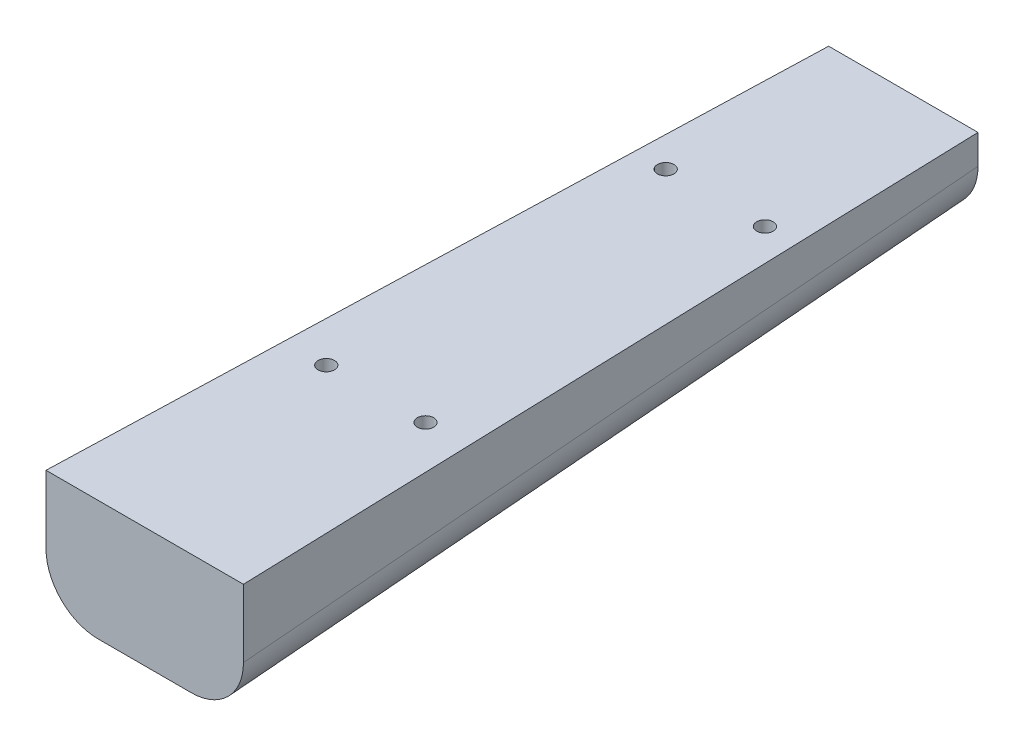
ISO-10303-21;
HEADER;
FILE_DESCRIPTION(('STEP AP214'),'2;1');
FILE_NAME('part.step','',(''),(''),'','','');
FILE_SCHEMA(('AUTOMOTIVE_DESIGN { 1 0 10303 214 1 1 1 1 }'));
ENDSEC;
DATA;
#1=APPLICATION_CONTEXT('core data for automotive mechanical design processes');
#2=APPLICATION_PROTOCOL_DEFINITION('international standard','automotive_design',2000,#1);
#3=PRODUCT_CONTEXT('',#1,'mechanical');
#4=PRODUCT('Part','Part','',(#3));
#5=PRODUCT_RELATED_PRODUCT_CATEGORY('part','',(#4));
#6=PRODUCT_DEFINITION_FORMATION('','',#4);
#7=PRODUCT_DEFINITION_CONTEXT('part definition',#1,'design');
#8=PRODUCT_DEFINITION('design','',#6,#7);
#9=PRODUCT_DEFINITION_SHAPE('','',#8);
#10=(LENGTH_UNIT() NAMED_UNIT(*) SI_UNIT(.MILLI.,.METRE.));
#11=(NAMED_UNIT(*) PLANE_ANGLE_UNIT() SI_UNIT($,.RADIAN.));
#12=(NAMED_UNIT(*) SI_UNIT($,.STERADIAN.) SOLID_ANGLE_UNIT());
#13=UNCERTAINTY_MEASURE_WITH_UNIT(LENGTH_MEASURE(1.E-05),#10,'distance_accuracy_value','');
#14=(GEOMETRIC_REPRESENTATION_CONTEXT(3) GLOBAL_UNCERTAINTY_ASSIGNED_CONTEXT((#13)) GLOBAL_UNIT_ASSIGNED_CONTEXT((#10,
#11,#12)) REPRESENTATION_CONTEXT('',''));
#15=CARTESIAN_POINT('',(0.,0.,0.));
#16=DIRECTION('',(0.,0.,1.));
#17=DIRECTION('',(1.,0.,0.));
#18=AXIS2_PLACEMENT_3D('',#15,#16,#17);
#19=CARTESIAN_POINT('',(0.,20.723241317766,0.));
#20=DIRECTION('',(0.,1.,0.));
#21=DIRECTION('',(0.,0.,1.));
#22=AXIS2_PLACEMENT_3D('',#19,#20,#21);
#23=PLANE('',#22);
#24=DIRECTION('',(-1.,0.,0.));
#25=VECTOR('',#24,1.);
#26=CARTESIAN_POINT('',(0.,20.723241317766,-1173.17130026192));
#27=LINE('',#26,#25);
#28=CARTESIAN_POINT('',(24.0069483527925,20.723241317766,-1173.17130026192));
#29=VERTEX_POINT('',#28);
#30=CARTESIAN_POINT('',(-24.0069483527925,20.723241317766,-1173.17130026192));
#31=VERTEX_POINT('',#30);
#32=EDGE_CURVE('E116',#29,#31,#27,.T.);
#33=ORIENTED_EDGE('',*,*,#32,.F.);
#34=DIRECTION('',(-0.0316721902279269,0.,-0.999498310336824));
#35=VECTOR('',#34,1.);
#36=CARTESIAN_POINT('',(61.1211296763861,20.723241317766,-1.93681172447798));
#37=LINE('',#36,#35);
#38=CARTESIAN_POINT('',(18.161,20.723241317766,-1357.6554));
#39=VERTEX_POINT('',#38);
#40=EDGE_CURVE('E125',#29,#39,#37,.T.);
#41=ORIENTED_EDGE('',*,*,#40,.T.);
#42=DIRECTION('',(-1.,0.,0.));
#43=VECTOR('',#42,1.);
#44=CARTESIAN_POINT('',(0.,20.723241317766,-1357.6554));
#45=LINE('',#44,#43);
#46=CARTESIAN_POINT('',(-18.161,20.723241317766,-1357.6554));
#47=VERTEX_POINT('',#46);
#48=EDGE_CURVE('E105',#39,#47,#45,.T.);
#49=ORIENTED_EDGE('',*,*,#48,.T.);
#50=DIRECTION('',(-0.0316721902279268,0.,0.999498310336824));
#51=VECTOR('',#50,1.);
#52=CARTESIAN_POINT('',(-61.1211296763861,20.723241317766,-1.93681172447797));
#53=LINE('',#52,#51);
#54=EDGE_CURVE('E123',#47,#31,#53,.T.);
#55=ORIENTED_EDGE('',*,*,#54,.T.);
#56=EDGE_LOOP('',(#33,#41,#49,#55));
#57=FACE_BOUND('',#56,.T.);
#58=CARTESIAN_POINT('',(12.065,20.723241317766,-1229.3854));
#59=DIRECTION('',(0.,1.,0.));
#60=DIRECTION('',(0.,0.,1.));
#61=AXIS2_PLACEMENT_3D('',#58,#59,#60);
#62=CIRCLE('',#61,2.);
#63=CARTESIAN_POINT('',(12.065,20.723241317766,-1227.3854));
#64=VERTEX_POINT('',#63);
#65=EDGE_CURVE('E131',#64,#64,#62,.F.);
#66=ORIENTED_EDGE('',*,*,#65,.T.);
#67=EDGE_LOOP('',(#66));
#68=FACE_BOUND('',#67,.T.);
#69=CARTESIAN_POINT('',(12.065,20.723241317766,-1311.9354));
#70=DIRECTION('',(0.,1.,0.));
#71=DIRECTION('',(0.,0.,1.));
#72=AXIS2_PLACEMENT_3D('',#69,#70,#71);
#73=CIRCLE('',#72,2.);
#74=CARTESIAN_POINT('',(12.065,20.723241317766,-1309.9354));
#75=VERTEX_POINT('',#74);
#76=EDGE_CURVE('E361',#75,#75,#73,.F.);
#77=ORIENTED_EDGE('',*,*,#76,.T.);
#78=EDGE_LOOP('',(#77));
#79=FACE_BOUND('',#78,.T.);
#80=CARTESIAN_POINT('',(-12.065,20.723241317766,-1229.3854));
#81=DIRECTION('',(0.,1.,0.));
#82=DIRECTION('',(0.,0.,1.));
#83=AXIS2_PLACEMENT_3D('',#80,#81,#82);
#84=CIRCLE('',#83,2.);
#85=CARTESIAN_POINT('',(-12.065,20.723241317766,-1227.3854));
#86=VERTEX_POINT('',#85);
#87=EDGE_CURVE('E364',#86,#86,#84,.F.);
#88=ORIENTED_EDGE('',*,*,#87,.T.);
#89=EDGE_LOOP('',(#88));
#90=FACE_BOUND('',#89,.T.);
#91=CARTESIAN_POINT('',(-12.065,20.723241317766,-1311.9354));
#92=DIRECTION('',(0.,1.,0.));
#93=DIRECTION('',(0.,0.,1.));
#94=AXIS2_PLACEMENT_3D('',#91,#92,#93);
#95=CIRCLE('',#94,2.);
#96=CARTESIAN_POINT('',(-12.065,20.723241317766,-1309.9354));
#97=VERTEX_POINT('',#96);
#98=EDGE_CURVE('E127',#97,#97,#95,.F.);
#99=ORIENTED_EDGE('',*,*,#98,.T.);
#100=EDGE_LOOP('',(#99));
#101=FACE_BOUND('',#100,.T.);
#102=ADVANCED_FACE('F45',(#57,#68,#79,#90,#101),#23,.T.);
#103=CARTESIAN_POINT('',(0.,0.,-1173.17130026192));
#104=DIRECTION('',(0.,0.,1.));
#105=DIRECTION('',(1.,0.,0.));
#106=AXIS2_PLACEMENT_3D('',#103,#104,#105);
#107=PLANE('',#106);
#108=DIRECTION('',(0.,1.,0.));
#109=VECTOR('',#108,1.);
#110=CARTESIAN_POINT('',(24.0069483527925,0.,-1173.17130026192));
#111=LINE('',#110,#109);
#112=CARTESIAN_POINT('',(24.0069483527925,4.23140159115264,-1173.17130026192));
#113=VERTEX_POINT('',#112);
#114=EDGE_CURVE('E272',#113,#29,#111,.T.);
#115=ORIENTED_EDGE('',*,*,#114,.T.);
#116=ORIENTED_EDGE('',*,*,#32,.T.);
#117=DIRECTION('',(0.,-1.,0.));
#118=VECTOR('',#117,1.);
#119=CARTESIAN_POINT('',(-24.0069483527925,0.,-1173.17130026192));
#120=LINE('',#119,#118);
#121=CARTESIAN_POINT('',(-24.0069483527925,4.23140159115264,-1173.17130026192));
#122=VERTEX_POINT('',#121);
#123=EDGE_CURVE('E63',#31,#122,#120,.T.);
#124=ORIENTED_EDGE('',*,*,#123,.T.);
#125=CARTESIAN_POINT('',(-11.3005736959707,4.25179537602321,-1173.17130026192));
#126=DIRECTION('',(0.,0.,1.));
#127=DIRECTION('',(-0.52999894000318,-0.847998304005088,0.));
#128=AXIS2_PLACEMENT_3D('',#125,#126,#127);
#129=ELLIPSE('',#128,12.7226792238703,12.7);
#130=CARTESIAN_POINT('',(-11.320951542641,-8.46451736446796,-1173.17130026192));
#131=VERTEX_POINT('',#130);
#132=EDGE_CURVE('E67',#131,#122,#129,.F.);
#133=ORIENTED_EDGE('',*,*,#132,.F.);
#134=DIRECTION('',(1.,0.,0.));
#135=VECTOR('',#134,1.);
#136=CARTESIAN_POINT('',(0.,-8.46451736446795,-1173.17130026192));
#137=LINE('',#136,#135);
#138=CARTESIAN_POINT('',(11.320951542641,-8.46451736446796,-1173.17130026192));
#139=VERTEX_POINT('',#138);
#140=EDGE_CURVE('E219',#131,#139,#137,.T.);
#141=ORIENTED_EDGE('',*,*,#140,.T.);
#142=CARTESIAN_POINT('',(11.3005736959707,4.2517953760232,-1173.17130026192));
#143=DIRECTION('',(0.,0.,1.));
#144=DIRECTION('',(0.52999894000318,-0.847998304005088,0.));
#145=AXIS2_PLACEMENT_3D('',#142,#143,#144);
#146=ELLIPSE('',#145,12.7226792238703,12.7);
#147=EDGE_CURVE('E273',#113,#139,#146,.F.);
#148=ORIENTED_EDGE('',*,*,#147,.F.);
#149=EDGE_LOOP('',(#115,#116,#124,#133,#141,#148));
#150=FACE_BOUND('',#149,.T.);
#151=ADVANCED_FACE('F175',(#150),#107,.T.);
#152=CARTESIAN_POINT('',(0.,0.,-1357.6554));
#153=DIRECTION('',(0.,0.,1.));
#154=DIRECTION('',(1.,0.,0.));
#155=AXIS2_PLACEMENT_3D('',#152,#153,#154);
#156=PLANE('',#155);
#157=ORIENTED_EDGE('',*,*,#48,.F.);
#158=CARTESIAN_POINT('',(18.161,13.5849189556207,-1357.6554));
#159=DIRECTION('',(0.,1.,0.));
#160=VECTOR('',#159,1.);
#161=LINE('',#158,#160);
#162=CARTESIAN_POINT('',(18.161,13.5849189556207,-1357.6554));
#163=VERTEX_POINT('',#162);
#164=EDGE_CURVE('E151',#163,#39,#161,.T.);
#165=ORIENTED_EDGE('',*,*,#164,.F.);
#166=CARTESIAN_POINT('',(5.45462534317825,13.6053127404912,-1357.6554));
#167=DIRECTION('',(0.,0.,1.));
#168=DIRECTION('',(0.52999894000318,-0.847998304005088,0.));
#169=AXIS2_PLACEMENT_3D('',#166,#167,#168);
#170=ELLIPSE('',#169,12.7226792238703,12.7);
#171=CARTESIAN_POINT('',(5.47500318984843,0.889000000000046,-1357.6554));
#172=VERTEX_POINT('',#171);
#173=EDGE_CURVE('E158',#163,#172,#170,.F.);
#174=ORIENTED_EDGE('',*,*,#173,.T.);
#175=CARTESIAN_POINT('',(-5.47500318984845,0.88900000000007,-1357.6554));
#176=DIRECTION('',(1.,0.,0.));
#177=VECTOR('',#176,1.);
#178=LINE('',#175,#177);
#179=CARTESIAN_POINT('',(-5.47500318984845,0.889000000000046,-1357.6554));
#180=VERTEX_POINT('',#179);
#181=EDGE_CURVE('E115',#180,#172,#178,.T.);
#182=ORIENTED_EDGE('',*,*,#181,.F.);
#183=CARTESIAN_POINT('',(-5.45462534317825,13.6053127404912,-1357.6554));
#184=DIRECTION('',(0.,0.,1.));
#185=DIRECTION('',(-0.52999894000318,-0.847998304005088,0.));
#186=AXIS2_PLACEMENT_3D('',#183,#184,#185);
#187=ELLIPSE('',#186,12.7226792238703,12.7);
#188=CARTESIAN_POINT('',(-18.161,13.5849189556206,-1357.6554));
#189=VERTEX_POINT('',#188);
#190=EDGE_CURVE('E109',#180,#189,#187,.F.);
#191=ORIENTED_EDGE('',*,*,#190,.T.);
#192=CARTESIAN_POINT('',(-18.161,20.723241317766,-1357.6554));
#193=DIRECTION('',(0.,-1.,0.));
#194=VECTOR('',#193,1.);
#195=LINE('',#192,#194);
#196=EDGE_CURVE('E100',#47,#189,#195,.T.);
#197=ORIENTED_EDGE('',*,*,#196,.F.);
#198=EDGE_LOOP('',(#157,#165,#174,#182,#191,#197));
#199=FACE_BOUND('',#198,.T.);
#200=ADVANCED_FACE('F103',(#199),#156,.F.);
#201=CARTESIAN_POINT('',(61.1211296763861,0.,-1.93681172447798));
#202=DIRECTION('',(-0.999498310336824,0.,0.0316721902279269));
#203=DIRECTION('',(0.0316721902279269,0.,0.999498310336824));
#204=AXIS2_PLACEMENT_3D('',#201,#202,#203);
#205=PLANE('',#204);
#206=ORIENTED_EDGE('',*,*,#40,.F.);
#207=ORIENTED_EDGE('',*,*,#114,.F.);
#208=DIRECTION('',(0.0316316011868878,-0.0506105618990205,0.99821741761533));
#209=VECTOR('',#208,1.);
#210=CARTESIAN_POINT('',(61.0328383585854,-55.010022418116,-4.72307381510543));
#211=LINE('',#210,#209);
#212=EDGE_CURVE('E208',#113,#163,#211,.F.);
#213=ORIENTED_EDGE('',*,*,#212,.T.);
#214=ORIENTED_EDGE('',*,*,#164,.T.);
#215=EDGE_LOOP('',(#206,#207,#213,#214));
#216=FACE_BOUND('',#215,.T.);
#217=ADVANCED_FACE('F47',(#216),#205,.F.);
#218=CARTESIAN_POINT('',(-61.1211296763861,0.,-1.93681172447797));
#219=DIRECTION('',(0.999498310336824,0.,0.0316721902279268));
#220=DIRECTION('',(0.0316721902279268,0.,-0.999498310336824));
#221=AXIS2_PLACEMENT_3D('',#218,#219,#220);
#222=PLANE('',#221);
#223=ORIENTED_EDGE('',*,*,#54,.F.);
#224=ORIENTED_EDGE('',*,*,#196,.T.);
#225=DIRECTION('',(-0.0316316011868878,-0.0506105618990205,0.998217417615331));
#226=VECTOR('',#225,1.);
#227=CARTESIAN_POINT('',(-61.0328383585854,-55.010022418116,-4.72307381510543));
#228=LINE('',#227,#226);
#229=EDGE_CURVE('E152',#189,#122,#228,.T.);
#230=ORIENTED_EDGE('',*,*,#229,.T.);
#231=ORIENTED_EDGE('',*,*,#123,.F.);
#232=EDGE_LOOP('',(#223,#224,#230,#231));
#233=FACE_BOUND('',#232,.T.);
#234=ADVANCED_FACE('F126',(#233),#222,.F.);
#235=CARTESIAN_POINT('',(-12.065,-8.46454236446797,-1311.9354));
#236=DIRECTION('',(0.,1.,0.));
#237=DIRECTION('',(0.,0.,1.));
#238=AXIS2_PLACEMENT_3D('',#235,#236,#237);
#239=CYLINDRICAL_SURFACE('',#238,2.);
#240=CARTESIAN_POINT('',(-12.065,-0.470140429083495,-1309.9354));
#241=CARTESIAN_POINT('',(-12.190454449731,-0.415341292933901,-1309.93540396265));
#242=CARTESIAN_POINT('',(-12.3147965376713,-0.357825540674882,-1309.94722872973));
#243=CARTESIAN_POINT('',(-12.5576515044099,-0.239271997339739,-1309.99307880621));
#244=CARTESIAN_POINT('',(-12.676156369196,-0.178229601155399,-1310.02713376971));
#245=CARTESIAN_POINT('',(-12.9040702864242,-0.0549241538420164,-1310.11581929779));
#246=CARTESIAN_POINT('',(-13.0135015529651,0.00733542546131464,-1310.17039768522));
#247=CARTESIAN_POINT('',(-13.2210813264998,0.130911919171698,-1310.29882460603));
#248=CARTESIAN_POINT('',(-13.3192260085461,0.192228507942954,-1310.37267964457));
#249=CARTESIAN_POINT('',(-13.5042894338816,0.312953488417157,-1310.54092770665));
#250=CARTESIAN_POINT('',(-13.5907887018879,0.372251285058992,-1310.63586508078));
#251=CARTESIAN_POINT('',(-13.7455385415762,0.48326561128192,-1310.84339445578));
#252=CARTESIAN_POINT('',(-13.8138191960381,0.534994574000619,-1310.95595686004));
#253=CARTESIAN_POINT('',(-13.9128189132748,0.614278224864288,-1311.16399884294));
#254=CARTESIAN_POINT('',(-13.9487000752468,0.644597025312217,-1311.2559815529));
#255=CARTESIAN_POINT('',(-14.0068389379443,0.697028322639501,-1311.44637876111));
#256=CARTESIAN_POINT('',(-14.0291087127825,0.719148085678401,-1311.54478747308));
#257=CARTESIAN_POINT('',(-14.0586329668677,0.753661716402574,-1311.74611509245));
#258=CARTESIAN_POINT('',(-14.0658044840359,0.766001615717355,-1311.84905576262));
#259=CARTESIAN_POINT('',(-14.0640527830666,0.779734017751632,-1312.05553552442));
#260=CARTESIAN_POINT('',(-14.0551346963718,0.781130010042434,-1312.15907441476));
#261=CARTESIAN_POINT('',(-14.0230194721182,0.773383772555391,-1312.35372606988));
#262=CARTESIAN_POINT('',(-14.0012005977893,0.765192205873714,-1312.44511017099));
#263=CARTESIAN_POINT('',(-13.9454309909002,0.74055809562651,-1312.62290464556));
#264=CARTESIAN_POINT('',(-13.9114788471525,0.724114592210732,-1312.70931443912));
#265=CARTESIAN_POINT('',(-13.8317451741576,0.683648918813197,-1312.87747461129));
#266=CARTESIAN_POINT('',(-13.7856736963208,0.659437252459765,-1312.9590405459));
#267=CARTESIAN_POINT('',(-13.6837634530327,0.605078941662254,-1313.11361311257));
#268=CARTESIAN_POINT('',(-13.627920893696,0.574929991335225,-1313.1866164015));
#269=CARTESIAN_POINT('',(-13.4999578219864,0.505813588080991,-1313.33236609096));
#270=CARTESIAN_POINT('',(-13.4266591374857,0.466206015478173,-1313.40377265977));
#271=CARTESIAN_POINT('',(-13.2714225407743,0.383109302755104,-1313.53377749464));
#272=CARTESIAN_POINT('',(-13.1894795127747,0.339617866497458,-1313.59236811236));
#273=CARTESIAN_POINT('',(-13.0059167863356,0.24367970921894,-1313.70397692244));
#274=CARTESIAN_POINT('',(-12.9031856682751,0.190865205123441,-1313.7548583087));
#275=CARTESIAN_POINT('',(-12.6910063813151,0.0842351423158335,-1313.8383255582));
#276=CARTESIAN_POINT('',(-12.5815549515295,0.0304191066003398,-1313.87090246052));
#277=CARTESIAN_POINT('',(-12.3491567739239,-0.0809357351828239,-1313.91894678507));
#278=CARTESIAN_POINT('',(-12.2258406345682,-0.138416496738399,-1313.93278580799));
#279=CARTESIAN_POINT('',(-11.9775658396401,-0.25075839939859,-1313.93734057183));
#280=CARTESIAN_POINT('',(-11.8526071717571,-0.305619520854926,-1313.92805613934));
#281=CARTESIAN_POINT('',(-11.606511097759,-0.410544123921925,-1313.8860826057));
#282=CARTESIAN_POINT('',(-11.485345229936,-0.460660151966255,-1313.85369547759));
#283=CARTESIAN_POINT('',(-11.2494768495882,-0.555712792852206,-1313.76590147467));
#284=CARTESIAN_POINT('',(-11.1347716611581,-0.600651558212878,-1313.71050421109));
#285=CARTESIAN_POINT('',(-10.9236521065454,-0.681767986438338,-1313.58208512685));
#286=CARTESIAN_POINT('',(-10.826530075496,-0.718328242435139,-1313.51046883971));
#287=CARTESIAN_POINT('',(-10.6457447529569,-0.78583531259075,-1313.34972857882));
#288=CARTESIAN_POINT('',(-10.5620762913345,-0.816784283721523,-1313.26061135997));
#289=CARTESIAN_POINT('',(-10.4165064340133,-0.871116834212685,-1313.0736473053));
#290=CARTESIAN_POINT('',(-10.3535581330022,-0.894856696787209,-1312.97671787394));
#291=CARTESIAN_POINT('',(-10.2449804580057,-0.937257133538088,-1312.77258693616));
#292=CARTESIAN_POINT('',(-10.1993469460671,-0.955918920989998,-1312.66538789169));
#293=CARTESIAN_POINT('',(-10.1287060130532,-0.987516913408837,-1312.44848096041));
#294=CARTESIAN_POINT('',(-10.1029411698417,-1.00065362654759,-1312.33904848062));
#295=CARTESIAN_POINT('',(-10.0700989463234,-1.02221007960337,-1312.11695958431));
#296=CARTESIAN_POINT('',(-10.0630190005333,-1.03063046695866,-1312.00430361254));
#297=CARTESIAN_POINT('',(-10.0678785074699,-1.04247530662428,-1311.78172772667));
#298=CARTESIAN_POINT('',(-10.0793870106202,-1.04600953262857,-1311.67180412069));
#299=CARTESIAN_POINT('',(-10.1203553772691,-1.04820323454453,-1311.45530568631));
#300=CARTESIAN_POINT('',(-10.1498134619085,-1.04686319344584,-1311.34873052716));
#301=CARTESIAN_POINT('',(-10.2252755944884,-1.03904787716066,-1311.14343031479));
#302=CARTESIAN_POINT('',(-10.2710535672304,-1.03264137722842,-1311.04461947509));
#303=CARTESIAN_POINT('',(-10.377745958939,-1.01445877455224,-1310.85609340467));
#304=CARTESIAN_POINT('',(-10.4386590433084,-1.00268314517569,-1310.76637737296));
#305=CARTESIAN_POINT('',(-10.5733877216895,-0.973551681869736,-1310.59875550234));
#306=CARTESIAN_POINT('',(-10.6471608531585,-0.95621405948867,-1310.5208123242));
#307=CARTESIAN_POINT('',(-10.8053094586229,-0.915834549025652,-1310.37831562637));
#308=CARTESIAN_POINT('',(-10.8896862241609,-0.892791965736549,-1310.31376374032));
#309=CARTESIAN_POINT('',(-11.0678961602926,-0.840638624381035,-1310.19837501654));
#310=CARTESIAN_POINT('',(-11.1618715288829,-0.811426658791132,-1310.14780427039));
#311=CARTESIAN_POINT('',(-11.3550181268051,-0.747554767825698,-1310.06268494784));
#312=CARTESIAN_POINT('',(-11.4541878351439,-0.712896431362238,-1310.02813171012));
#313=CARTESIAN_POINT('',(-11.6388916859722,-0.644656333496246,-1309.9793708587));
#314=CARTESIAN_POINT('',(-11.7240771736478,-0.611784921826169,-1309.96279683716));
#315=CARTESIAN_POINT('',(-11.8946782516,-0.54307094553763,-1309.94080906794));
#316=CARTESIAN_POINT('',(-11.9800938803293,-0.507227850229144,-1309.93539731812));
#317=CARTESIAN_POINT('',(-12.065,-0.470140429083495,-1309.9354));
#318=B_SPLINE_CURVE_WITH_KNOTS('',3,(#240,#241,#242,#243,#244,#245,#246,#247,#248,#249,#250,
#251,#252,#253,#254,#255,#256,#257,#258,#259,#260,#261,#262,#263,#264,#265,#266,#267,#268,#269,
#270,#271,#272,#273,#274,#275,#276,#277,#278,#279,#280,#281,#282,#283,#284,#285,#286,#287,#288,
#289,#290,#291,#292,#293,#294,#295,#296,#297,#298,#299,#300,#301,#302,#303,#304,#305,#306,#307,
#308,#309,#310,#311,#312,#313,#314,#315,#316,#317),.UNSPECIFIED.,.T.,.F.,(4,2,2,2,2,2,2,2,2,2,2,
2,2,2,2,2,2,2,2,2,2,2,2,2,2,2,2,2,2,2,2,2,2,2,2,2,2,2,4),(0.,0.410346121845191,0.82124074923001,
1.23109773638543,1.6410932145304,2.06325335573305,2.48471204591246,2.79331356692462,
3.10164094115751,3.41165814112863,3.7215764850749,4.00319446272566,4.28484520526189,
4.57396847622111,4.86320425719379,5.1911181963344,5.51922729787118,5.8963064359051,
6.27357001200158,6.68187627418348,7.0901855983343,7.49325350187329,7.89615321488433,
8.27244535475082,8.64859254021895,9.00078443575807,9.35289211006202,9.69080353717365,
10.0286685657858,10.3588124221544,10.6889235655606,11.0146289347127,11.3403055937173,
11.6649265957281,11.9895871755765,12.3200573389205,12.6504312700132,12.9280990824662,
13.2058165887205),.UNSPECIFIED.);
#319=CARTESIAN_POINT('',(-12.065,-0.470140429083495,-1309.9354));
#320=VERTEX_POINT('',#319);
#321=EDGE_CURVE('E11',#320,#320,#318,.T.);
#322=ORIENTED_EDGE('',*,*,#321,.T.);
#323=EDGE_LOOP('',(#322));
#324=FACE_BOUND('',#323,.T.);
#325=ORIENTED_EDGE('',*,*,#98,.F.);
#326=EDGE_LOOP('',(#325));
#327=FACE_BOUND('',#326,.T.);
#328=ADVANCED_FACE('F242',(#324,#327),#239,.F.);
#329=CARTESIAN_POINT('',(12.065,-8.46454236446798,-1229.3854));
#330=DIRECTION('',(0.,1.,0.));
#331=DIRECTION('',(0.,0.,1.));
#332=AXIS2_PLACEMENT_3D('',#329,#330,#331);
#333=CYLINDRICAL_SURFACE('',#332,2.);
#334=CARTESIAN_POINT('',(12.065,-5.47474669687189,-1227.3854));
#335=CARTESIAN_POINT('',(11.9555036465728,-5.49639840749928,-1227.38540332994));
#336=CARTESIAN_POINT('',(11.845577454237,-5.51610819663427,-1227.39441855275));
#337=CARTESIAN_POINT('',(11.6279943078821,-5.55120390702598,-1227.43061131004));
#338=CARTESIAN_POINT('',(11.5203385037257,-5.56658768376873,-1227.45779783003));
#339=CARTESIAN_POINT('',(11.3104746012888,-5.59294092432978,-1227.52986677566));
#340=CARTESIAN_POINT('',(11.2082693359396,-5.60390811164539,-1227.57475830369));
#341=CARTESIAN_POINT('',(11.0124867966105,-5.62164956486528,-1227.6811038797));
#342=CARTESIAN_POINT('',(10.9189086521282,-5.62842425420013,-1227.74255625417));
#343=CARTESIAN_POINT('',(10.7441594625718,-5.63822739721586,-1227.87955377478));
#344=CARTESIAN_POINT('',(10.6628636397668,-5.64129610859553,-1227.9549370277));
#345=CARTESIAN_POINT('',(10.513802883309,-5.64446245648934,-1228.11811921609));
#346=CARTESIAN_POINT('',(10.4460383664696,-5.64456000149478,-1228.20591853387));
#347=CARTESIAN_POINT('',(10.3256691573067,-5.64246859841333,-1228.39189460533));
#348=CARTESIAN_POINT('',(10.2731343755437,-5.64026931284857,-1228.49011647348));
#349=CARTESIAN_POINT('',(10.1850806791603,-5.63421575012122,-1228.69386428173));
#350=CARTESIAN_POINT('',(10.1495625144653,-5.63036140003383,-1228.7993905435));
#351=CARTESIAN_POINT('',(10.0962601029282,-5.62147017526935,-1229.01581169884));
#352=CARTESIAN_POINT('',(10.0786411576832,-5.61642279940293,-1229.12674689216));
#353=CARTESIAN_POINT('',(10.0621847610014,-5.60549487852597,-1229.3499610321));
#354=CARTESIAN_POINT('',(10.0633477896243,-5.59961431222322,-1229.462240013));
#355=CARTESIAN_POINT('',(10.0844545908125,-5.58709302335108,-1229.68552470709));
#356=CARTESIAN_POINT('',(10.1044887885357,-5.58044877610954,-1229.79652168352));
#357=CARTESIAN_POINT('',(10.1628756087289,-5.56630328191401,-1230.01353102901));
#358=CARTESIAN_POINT('',(10.2012284204333,-5.55880202610757,-1230.11954334656));
#359=CARTESIAN_POINT('',(10.2952059262994,-5.54262223933512,-1230.32374004006));
#360=CARTESIAN_POINT('',(10.350860194228,-5.53394170701858,-1230.42191064807));
#361=CARTESIAN_POINT('',(10.4777675218926,-5.51498694967284,-1230.60741565092));
#362=CARTESIAN_POINT('',(10.5490204547907,-5.50471273760258,-1230.69475013386));
#363=CARTESIAN_POINT('',(10.7050597929538,-5.48210574911387,-1230.85617317024));
#364=CARTESIAN_POINT('',(10.7898569132615,-5.46977134248335,-1230.930251137));
#365=CARTESIAN_POINT('',(10.9703965484828,-5.44266234488309,-1231.0630170699));
#366=CARTESIAN_POINT('',(11.0661389680767,-5.42788777516357,-1231.12170517005));
#367=CARTESIAN_POINT('',(11.2659790570214,-5.39562873447923,-1231.22227555512));
#368=CARTESIAN_POINT('',(11.370098316284,-5.37813714550158,-1231.26411262885));
#369=CARTESIAN_POINT('',(11.5834072117995,-5.34047863142793,-1231.32975691773));
#370=CARTESIAN_POINT('',(11.6925971015974,-5.32031157245752,-1231.35356323026));
#371=CARTESIAN_POINT('',(11.9141834692909,-5.27734148697728,-1231.3828695054));
#372=CARTESIAN_POINT('',(12.0266021700276,-5.25451145061834,-1231.38816130598));
#373=CARTESIAN_POINT('',(12.2503502591095,-5.20697963353351,-1231.3799384057));
#374=CARTESIAN_POINT('',(12.3616795043067,-5.18227761047148,-1231.366421266));
#375=CARTESIAN_POINT('',(12.5825725586906,-5.1313320675836,-1231.32062679736));
#376=CARTESIAN_POINT('',(12.6920523063673,-5.10506723855189,-1231.2879674572));
#377=CARTESIAN_POINT('',(12.9039103434867,-5.05263448002667,-1231.2045194601));
#378=CARTESIAN_POINT('',(13.0062875829221,-5.02646656539961,-1231.1537281294));
#379=CARTESIAN_POINT('',(13.2024287868197,-4.97528141893114,-1231.03451833052));
#380=CARTESIAN_POINT('',(13.2960670062428,-4.95028299613506,-1230.96588441712));
#381=CARTESIAN_POINT('',(13.4705052642129,-4.9033909066454,-1230.81298583862));
#382=CARTESIAN_POINT('',(13.5513062980239,-4.88149699927361,-1230.72872238638));
#383=CARTESIAN_POINT('',(13.6958599958104,-4.84289634214452,-1230.54872495146));
#384=CARTESIAN_POINT('',(13.7599468874267,-4.82608661268924,-1230.45328216216));
#385=CARTESIAN_POINT('',(13.8710782899268,-4.7984831838335,-1230.25215545756));
#386=CARTESIAN_POINT('',(13.9181301023896,-4.78768690587531,-1230.1464759546));
#387=CARTESIAN_POINT('',(13.991371039864,-4.77363097558698,-1229.93406051066));
#388=CARTESIAN_POINT('',(14.0185506378993,-4.7699953869628,-1229.8276906415));
#389=CARTESIAN_POINT('',(14.0551365719564,-4.76962720905034,-1229.61193758364));
#390=CARTESIAN_POINT('',(14.0645475217682,-4.77289282733446,-1229.50255518466));
#391=CARTESIAN_POINT('',(14.065404407049,-4.7860224811416,-1229.28826374865));
#392=CARTESIAN_POINT('',(14.057510482605,-4.79563460816414,-1229.18334071176));
#393=CARTESIAN_POINT('',(14.0255871361875,-4.82067594522573,-1228.97670629651));
#394=CARTESIAN_POINT('',(14.0015563951196,-4.83610563077239,-1228.87499518141));
#395=CARTESIAN_POINT('',(13.9377058914294,-4.87224909467348,-1228.67534371355));
#396=CARTESIAN_POINT('',(13.8975778921761,-4.8930630338961,-1228.5775205563));
#397=CARTESIAN_POINT('',(13.8029364755217,-4.93862603040251,-1228.39010802811));
#398=CARTESIAN_POINT('',(13.748419476091,-4.96337606693645,-1228.30052071493));
#399=CARTESIAN_POINT('',(13.6227655410813,-5.01713813784116,-1228.12618861321));
#400=CARTESIAN_POINT('',(13.5508087481461,-5.04631915389375,-1228.04208679408));
#401=CARTESIAN_POINT('',(13.3943401820046,-5.10612737276935,-1227.88706992992));
#402=CARTESIAN_POINT('',(13.3098224155443,-5.136755261158,-1227.81616121633));
#403=CARTESIAN_POINT('',(13.1256085963535,-5.19957100533627,-1227.68584382847));
#404=CARTESIAN_POINT('',(13.0253515369314,-5.23175709236353,-1227.62722569716));
#405=CARTESIAN_POINT('',(12.8158505764649,-5.29449286444016,-1227.52808161795));
#406=CARTESIAN_POINT('',(12.7066139995675,-5.32504385022588,-1227.48754109509));
#407=CARTESIAN_POINT('',(12.508701134628,-5.3762635809881,-1227.43321406574));
#408=CARTESIAN_POINT('',(12.4212815233797,-5.39755931799042,-1227.41536548835));
#409=CARTESIAN_POINT('',(12.2443375287042,-5.43792095554878,-1227.3914576914));
#410=CARTESIAN_POINT('',(12.15481336103,-5.45698708349092,-1227.38539726865));
#411=CARTESIAN_POINT('',(12.065,-5.47474669687189,-1227.3854));
#412=B_SPLINE_CURVE_WITH_KNOTS('',3,(#334,#335,#336,#337,#338,#339,#340,#341,#342,#343,#344,
#345,#346,#347,#348,#349,#350,#351,#352,#353,#354,#355,#356,#357,#358,#359,#360,#361,#362,#363,
#364,#365,#366,#367,#368,#369,#370,#371,#372,#373,#374,#375,#376,#377,#378,#379,#380,#381,#382,
#383,#384,#385,#386,#387,#388,#389,#390,#391,#392,#393,#394,#395,#396,#397,#398,#399,#400,#401,
#402,#403,#404,#405,#406,#407,#408,#409,#410,#411),.UNSPECIFIED.,.T.,.F.,(4,2,2,2,2,2,2,2,2,2,2,
2,2,2,2,2,2,2,2,2,2,2,2,2,2,2,2,2,2,2,2,2,2,2,2,2,2,2,4),(0.,0.334531942695092,
0.669229430176229,1.00409921519357,1.33893517377554,1.67010014431204,2.00127531435863,
2.33394747380761,2.66663429283046,3.00236632871317,3.33810694578768,3.67546456248007,
4.01282566420737,4.35076662534466,4.68870483867619,5.02691173721066,5.3651156906205,
5.70422109360336,6.04334347104997,6.3862666227869,6.72923424337589,7.07929125513192,
7.42939990816225,7.78395007058001,8.13847273137648,8.48524128175518,8.8318610236751,
9.15973933189829,9.48753249184149,9.8030393680878,10.1185720383945,10.4404593892839,
10.7624269472271,11.104323357242,11.4463834241423,11.8062451783447,12.165816269482,
12.4402409820057,12.7146376829449),.UNSPECIFIED.);
#413=CARTESIAN_POINT('',(12.065,-5.47474669687189,-1227.3854));
#414=VERTEX_POINT('',#413);
#415=EDGE_CURVE('E55',#414,#414,#412,.T.);
#416=ORIENTED_EDGE('',*,*,#415,.T.);
#417=EDGE_LOOP('',(#416));
#418=FACE_BOUND('',#417,.T.);
#419=ORIENTED_EDGE('',*,*,#65,.F.);
#420=EDGE_LOOP('',(#419));
#421=FACE_BOUND('',#420,.T.);
#422=ADVANCED_FACE('F238',(#418,#421),#333,.F.);
#423=CARTESIAN_POINT('',(-12.065,-8.46454236446798,-1229.3854));
#424=DIRECTION('',(0.,1.,0.));
#425=DIRECTION('',(0.,0.,1.));
#426=AXIS2_PLACEMENT_3D('',#423,#424,#425);
#427=CYLINDRICAL_SURFACE('',#426,2.);
#428=CARTESIAN_POINT('',(-12.065,-5.4747466968719,-1227.3854));
#429=CARTESIAN_POINT('',(-12.1803804041452,-5.45192706518782,-1227.38540538339));
#430=CARTESIAN_POINT('',(-12.295415825107,-5.42692451983197,-1227.39541981505));
#431=CARTESIAN_POINT('',(-12.5213846006532,-5.37341098680974,-1227.43478311526));
#432=CARTESIAN_POINT('',(-12.6323117918783,-5.34489498500038,-1227.46415988234));
#433=CARTESIAN_POINT('',(-12.8467832869349,-5.28559606896769,-1227.54101367083));
#434=CARTESIAN_POINT('',(-12.9503420457247,-5.25481784825572,-1227.58845402523));
#435=CARTESIAN_POINT('',(-13.1477100262161,-5.19232736035125,-1227.69999460811));
#436=CARTESIAN_POINT('',(-13.2415206694937,-5.16061523021966,-1227.76409240266));
#437=CARTESIAN_POINT('',(-13.4193787331898,-5.09696901281881,-1227.90919944586));
#438=CARTESIAN_POINT('',(-13.5031093788766,-5.06505054481087,-1227.99060461221));
#439=CARTESIAN_POINT('',(-13.6555298241723,-5.00362593457403,-1228.1672766027));
#440=CARTESIAN_POINT('',(-13.724218444184,-4.97411998164844,-1228.26254451298));
#441=CARTESIAN_POINT('',(-13.8436622577927,-4.91965157125877,-1228.46351153146));
#442=CARTESIAN_POINT('',(-13.8945968184145,-4.89464498405805,-1228.56909163381));
#443=CARTESIAN_POINT('',(-13.9774816286384,-4.85052129840861,-1228.78860932098));
#444=CARTESIAN_POINT('',(-14.0094407290588,-4.8314014561829,-1228.90254298151));
#445=CARTESIAN_POINT('',(-14.0515167892033,-4.80137939590268,-1229.12824157665));
#446=CARTESIAN_POINT('',(-14.0628279398809,-4.79005337447203,-1229.23972729368));
#447=CARTESIAN_POINT('',(-14.0666012923321,-4.77456191800225,-1229.46350181028));
#448=CARTESIAN_POINT('',(-14.059070760048,-4.77039372372645,-1229.57579028364));
#449=CARTESIAN_POINT('',(-14.0262218638925,-4.76935987450207,-1229.79141340174));
#450=CARTESIAN_POINT('',(-14.0019055268512,-4.7721048518521,-1229.89490066691));
#451=CARTESIAN_POINT('',(-13.9373405901393,-4.78367428947374,-1230.09640907096));
#452=CARTESIAN_POINT('',(-13.8970920437892,-4.79249872939918,-1230.19443022812));
#453=CARTESIAN_POINT('',(-13.8018979133378,-4.81543025711491,-1230.38255656419));
#454=CARTESIAN_POINT('',(-13.7469285968245,-4.82954589003786,-1230.47264864566));
#455=CARTESIAN_POINT('',(-13.6239831888042,-4.86198099573251,-1230.64261095099));
#456=CARTESIAN_POINT('',(-13.5560043968633,-4.88030134145246,-1230.72247904687));
#457=CARTESIAN_POINT('',(-13.4053193190927,-4.92092123790667,-1230.87385298887));
#458=CARTESIAN_POINT('',(-13.3220599290263,-4.94337034055224,-1230.94476791838));
#459=CARTESIAN_POINT('',(-13.1454937189519,-4.99023044649353,-1231.07192840566));
#460=CARTESIAN_POINT('',(-13.0521842977402,-5.01464195729372,-1231.12817015269));
#461=CARTESIAN_POINT('',(-12.8531537736666,-5.06535716304272,-1231.22706864067));
#462=CARTESIAN_POINT('',(-12.7470517313437,-5.09169541724396,-1231.26894281961));
#463=CARTESIAN_POINT('',(-12.5291625015081,-5.14386933371585,-1231.33411407849));
#464=CARTESIAN_POINT('',(-12.4173747659037,-5.16970494719959,-1231.35740936384));
#465=CARTESIAN_POINT('',(-12.1895779237816,-5.22017865729333,-1231.38485364107));
#466=CARTESIAN_POINT('',(-12.0735321430733,-5.24479578546349,-1231.38873893815));
#467=CARTESIAN_POINT('',(-11.8420413372377,-5.2916583144349,-1231.3763095855));
#468=CARTESIAN_POINT('',(-11.7265962586913,-5.31390392968074,-1231.35999676386));
#469=CARTESIAN_POINT('',(-11.5016496216041,-5.35522512187803,-1231.30783326876));
#470=CARTESIAN_POINT('',(-11.3920820472044,-5.37434624672513,-1231.27230364703));
#471=CARTESIAN_POINT('',(-11.1802841212098,-5.40972274553024,-1231.18275704512));
#472=CARTESIAN_POINT('',(-11.0780529817181,-5.42597842749655,-1231.12874205377));
#473=CARTESIAN_POINT('',(-10.88604404183,-5.45549234381405,-1231.00492417662));
#474=CARTESIAN_POINT('',(-10.7960619977455,-5.46880292450237,-1230.93545027963));
#475=CARTESIAN_POINT('',(-10.6289971509928,-5.49317449960399,-1230.78209283631));
#476=CARTESIAN_POINT('',(-10.5519137386277,-5.50423560035178,-1230.69820997144));
#477=CARTESIAN_POINT('',(-10.4136087502242,-5.52447745165185,-1230.5192373318));
#478=CARTESIAN_POINT('',(-10.3522551150784,-5.5336737118975,-1230.42425131516));
#479=CARTESIAN_POINT('',(-10.2463704964114,-5.55075645215499,-1230.22521707713));
#480=CARTESIAN_POINT('',(-10.2018393050538,-5.5586429483479,-1230.12116896773));
#481=CARTESIAN_POINT('',(-10.1309831179133,-5.57345283138441,-1229.90718519979));
#482=CARTESIAN_POINT('',(-10.1046266923704,-5.58037786424158,-1229.79726006108));
#483=CARTESIAN_POINT('',(-10.0707747637205,-5.59347116865028,-1229.57449780477));
#484=CARTESIAN_POINT('',(-10.0632793023842,-5.5996394385258,-1229.46166068074));
#485=CARTESIAN_POINT('',(-10.0673821976378,-5.61118611501412,-1229.23639612391));
#486=CARTESIAN_POINT('',(-10.0789631696224,-5.61656523592454,-1229.12396841158));
#487=CARTESIAN_POINT('',(-10.1208787561004,-5.62627835475905,-1228.90261555044));
#488=CARTESIAN_POINT('',(-10.1512134124027,-5.63061235035314,-1228.79369040944));
#489=CARTESIAN_POINT('',(-10.2297098405101,-5.63774877932224,-1228.58268368501));
#490=CARTESIAN_POINT('',(-10.2778320797155,-5.64055457514676,-1228.48058751408));
#491=CARTESIAN_POINT('',(-10.3905587410152,-5.64400977700598,-1228.28590165916));
#492=CARTESIAN_POINT('',(-10.4551620651205,-5.6446593266519,-1228.19331134244));
#493=CARTESIAN_POINT('',(-10.598538357856,-5.64308566245217,-1228.02085387592));
#494=CARTESIAN_POINT('',(-10.677219723309,-5.64088047732073,-1227.94091042226));
#495=CARTESIAN_POINT('',(-10.846735552557,-5.63293943190465,-1227.79533344955));
#496=CARTESIAN_POINT('',(-10.9375714770064,-5.62720314697702,-1227.72970165287));
#497=CARTESIAN_POINT('',(-11.1277775974871,-5.61171937042128,-1227.61513607882));
#498=CARTESIAN_POINT('',(-11.2270633580928,-5.60200855321682,-1227.56605692472));
#499=CARTESIAN_POINT('',(-11.4318381940779,-5.578275256131,-1227.4850832258));
#500=CARTESIAN_POINT('',(-11.5373205754808,-5.56425736218736,-1227.45317050204));
#501=CARTESIAN_POINT('',(-11.7136753360066,-5.53762161750635,-1227.41521761001));
#502=CARTESIAN_POINT('',(-11.7836737200955,-5.52624505291025,-1227.40402553514));
#503=CARTESIAN_POINT('',(-11.9241575016766,-5.50176509724951,-1227.38911516286));
#504=CARTESIAN_POINT('',(-11.9946428894874,-5.48866174041979,-1227.38539671729));
#505=CARTESIAN_POINT('',(-12.065,-5.4747466968719,-1227.3854));
#506=B_SPLINE_CURVE_WITH_KNOTS('',3,(#428,#429,#430,#431,#432,#433,#434,#435,#436,#437,#438,
#439,#440,#441,#442,#443,#444,#445,#446,#447,#448,#449,#450,#451,#452,#453,#454,#455,#456,#457,
#458,#459,#460,#461,#462,#463,#464,#465,#466,#467,#468,#469,#470,#471,#472,#473,#474,#475,#476,
#477,#478,#479,#480,#481,#482,#483,#484,#485,#486,#487,#488,#489,#490,#491,#492,#493,#494,#495,
#496,#497,#498,#499,#500,#501,#502,#503,#504,#505),.UNSPECIFIED.,.T.,.F.,(4,2,2,2,2,2,2,2,2,2,2,
2,2,2,2,2,2,2,2,2,2,2,2,2,2,2,2,2,2,2,2,2,2,2,2,2,2,2,4),(0.,0.35257368050108,0.705656486220877,
1.05802636236671,1.41034477978035,1.77181180153052,2.13330715942102,2.49103664073283,
2.84859913315225,3.18473338336675,3.52073802968061,3.83824588364241,4.15575267500407,
4.47377445596902,4.79186232184886,5.12532760848557,5.45887941277604,5.80845752751769,
6.1580694051331,6.51241826630934,6.86673505818463,7.21530737302393,7.56384219672075,
7.90556918490993,8.24728001566899,8.58602041953232,8.92475663821989,9.26290559880514,
9.60105530827553,9.93889702790953,10.2767395007206,10.6138355952783,10.9509092379674,
11.2858644841646,11.6208600192791,11.9528317263907,12.2844511860855,12.4994491948078,
12.7144429416804),.UNSPECIFIED.);
#507=CARTESIAN_POINT('',(-12.065,-5.4747466968719,-1227.3854));
#508=VERTEX_POINT('',#507);
#509=EDGE_CURVE('E218',#508,#508,#506,.T.);
#510=ORIENTED_EDGE('',*,*,#509,.T.);
#511=EDGE_LOOP('',(#510));
#512=FACE_BOUND('',#511,.T.);
#513=ORIENTED_EDGE('',*,*,#87,.F.);
#514=EDGE_LOOP('',(#513));
#515=FACE_BOUND('',#514,.T.);
#516=ADVANCED_FACE('F233',(#512,#515),#427,.F.);
#517=CARTESIAN_POINT('',(12.065,-8.46454236446797,-1311.9354));
#518=DIRECTION('',(0.,1.,0.));
#519=DIRECTION('',(0.,0.,1.));
#520=AXIS2_PLACEMENT_3D('',#517,#518,#519);
#521=CYLINDRICAL_SURFACE('',#520,2.);
#522=CARTESIAN_POINT('',(12.065,-0.470140429083487,-1309.9354));
#523=CARTESIAN_POINT('',(11.9535822088038,-0.518806859316758,-1309.9353988449));
#524=CARTESIAN_POINT('',(11.8412454569178,-0.565345974076981,-1309.94472076931));
#525=CARTESIAN_POINT('',(11.61774201339,-0.653023976582669,-1309.98276308791));
#526=CARTESIAN_POINT('',(11.5065747726175,-0.694165513278404,-1310.01147392382));
#527=CARTESIAN_POINT('',(11.288519669532,-0.770268340334077,-1310.08864612337));
#528=CARTESIAN_POINT('',(11.1816490600467,-0.805206331194197,-1310.13717977724));
#529=CARTESIAN_POINT('',(10.9765670178502,-0.868089720429266,-1310.25338055111));
#530=CARTESIAN_POINT('',(10.8783538843941,-0.896036494207307,-1310.32104390207));
#531=CARTESIAN_POINT('',(10.7003127073397,-0.943168323260554,-1310.46904952441));
#532=CARTESIAN_POINT('',(10.6197179466909,-0.962792937450581,-1310.54833055734));
#533=CARTESIAN_POINT('',(10.4725617947989,-0.995774739010816,-1310.72011365688));
#534=CARTESIAN_POINT('',(10.4059967894819,-1.00913354154729,-1310.81261230828));
#535=CARTESIAN_POINT('',(10.2918631708372,-1.02941590035429,-1311.00381713187));
#536=CARTESIAN_POINT('',(10.2435964899354,-1.03659318650247,-1311.10208074335));
#537=CARTESIAN_POINT('',(10.1636876203579,-1.04579538231638,-1311.30537158606));
#538=CARTESIAN_POINT('',(10.1320440494909,-1.0478207204141,-1311.41039825412));
#539=CARTESIAN_POINT('',(10.0865517455148,-1.04703639792475,-1311.62319321718));
#540=CARTESIAN_POINT('',(10.0725410146126,-1.04427131650945,-1311.73092713773));
#541=CARTESIAN_POINT('',(10.0621102277074,-1.03422985623406,-1311.94703016857));
#542=CARTESIAN_POINT('',(10.0656904292152,-1.0269534113342,-1312.05539928814));
#543=CARTESIAN_POINT('',(10.0902899620237,-1.00796238130031,-1312.27055868838));
#544=CARTESIAN_POINT('',(10.1114384123184,-0.996215286262466,-1312.37733130272));
#545=CARTESIAN_POINT('',(10.170519870946,-0.968345991866071,-1312.58551949574));
#546=CARTESIAN_POINT('',(10.208453610136,-0.952223602012344,-1312.68693484094));
#547=CARTESIAN_POINT('',(10.3004729642999,-0.915318409703842,-1312.88322681512));
#548=CARTESIAN_POINT('',(10.3548023156591,-0.894466551003602,-1312.97797611175));
#549=CARTESIAN_POINT('',(10.4774740156489,-0.848256105163689,-1313.15667428207));
#550=CARTESIAN_POINT('',(10.545817470205,-0.822897162367684,-1313.24062230253));
#551=CARTESIAN_POINT('',(10.6961322581435,-0.76702966100878,-1313.39769881587));
#552=CARTESIAN_POINT('',(10.7784084170057,-0.736405609632417,-1313.47049420518));
#553=CARTESIAN_POINT('',(10.9525459603887,-0.670689990067295,-1313.60102135598));
#554=CARTESIAN_POINT('',(11.0444089263147,-0.635597684600559,-1313.6587506267));
#555=CARTESIAN_POINT('',(11.2389650225724,-0.559725871499423,-1313.76028741076));
#556=CARTESIAN_POINT('',(11.3419531550008,-0.518767461497845,-1313.80339491147));
#557=CARTESIAN_POINT('',(11.5521723296968,-0.433018255940201,-1313.87169400887));
#558=CARTESIAN_POINT('',(11.6594045446933,-0.38822639709121,-1313.89688061663));
#559=CARTESIAN_POINT('',(11.8819853018878,-0.292741290951177,-1313.93038044584));
#560=CARTESIAN_POINT('',(11.9974233280039,-0.24185423955862,-1313.93754483637));
#561=CARTESIAN_POINT('',(12.2268344112092,-0.137877860327295,-1313.93214444538));
#562=CARTESIAN_POINT('',(12.3408069821115,-0.0847878251116914,-1313.91957327828));
#563=CARTESIAN_POINT('',(12.5718325491777,0.0256240873651529,-1313.87392085788));
#564=CARTESIAN_POINT('',(12.6886112700566,0.0829983186429859,-1313.83957094201));
#565=CARTESIAN_POINT('',(12.9145985578612,0.196635235607407,-1313.75005317539));
#566=CARTESIAN_POINT('',(13.0238020591729,0.252897159846551,-1313.69487155016));
#567=CARTESIAN_POINT('',(13.2335472979449,0.362816411311016,-1313.56331534895));
#568=CARTESIAN_POINT('',(13.3338929254197,0.416406853804496,-1313.48656986532));
#569=CARTESIAN_POINT('',(13.5200527935512,0.516565436191963,-1313.31341429697));
#570=CARTESIAN_POINT('',(13.6058884744452,0.563143925764335,-1313.2170336986));
#571=CARTESIAN_POINT('',(13.7401732984044,0.635277099998146,-1313.03241359851));
#572=CARTESIAN_POINT('',(13.7926263036138,0.663185367128778,-1312.94799414086));
#573=CARTESIAN_POINT('',(13.8850595781456,0.710979869295502,-1312.77048681679));
#574=CARTESIAN_POINT('',(13.9250501818851,0.730872755099904,-1312.67740621624));
#575=CARTESIAN_POINT('',(13.9909236730978,0.761069455525696,-1312.48428579896));
#576=CARTESIAN_POINT('',(14.0167304775075,0.771321761934474,-1312.38421163543));
#577=CARTESIAN_POINT('',(14.0525736248675,0.78095250280418,-1312.18076643856));
#578=CARTESIAN_POINT('',(14.0626155941458,0.780334817628738,-1312.07739659487));
#579=CARTESIAN_POINT('',(14.0664491009242,0.768705820191568,-1311.8803833805));
#580=CARTESIAN_POINT('',(14.0616274791433,0.758639042312946,-1311.78670540854));
#581=CARTESIAN_POINT('',(14.0392402401647,0.730138940454722,-1311.60221332317));
#582=CARTESIAN_POINT('',(14.0216731370581,0.711704641056543,-1311.51139954498));
#583=CARTESIAN_POINT('',(13.9742470239841,0.667069869993678,-1311.33243053488));
#584=CARTESIAN_POINT('',(13.9440820175545,0.640680967331615,-1311.24440470336));
#585=CARTESIAN_POINT('',(13.8728469569002,0.581818126371766,-1311.07508786558));
#586=CARTESIAN_POINT('',(13.8317724755667,0.549341719318164,-1310.99379961107));
#587=CARTESIAN_POINT('',(13.7336543458068,0.474888647866182,-1310.82809783613));
#588=CARTESIAN_POINT('',(13.6751786778674,0.432218360729737,-1310.74484618832));
#589=CARTESIAN_POINT('',(13.5476599720811,0.342834793339719,-1310.589351931));
#590=CARTESIAN_POINT('',(13.4786107289537,0.29611914603932,-1310.51711583616));
#591=CARTESIAN_POINT('',(13.3193677496718,0.192424338846442,-1310.37338963751));
#592=CARTESIAN_POINT('',(13.2275645355471,0.135021940183757,-1310.30398163651));
#593=CARTESIAN_POINT('',(13.033868566592,0.0192422442319192,-1310.18200035496));
#594=CARTESIAN_POINT('',(12.9319678448119,-0.039135792158388,-1310.12944050833));
#595=CARTESIAN_POINT('',(12.7070117417544,-0.162104204897682,-1310.03687833181));
#596=CARTESIAN_POINT('',(12.5829004646876,-0.226566375976198,-1309.99924412496));
#597=CARTESIAN_POINT('',(12.3279541857247,-0.35172818294615,-1309.94851291724));
#598=CARTESIAN_POINT('',(12.1971232172448,-0.41243002874971,-1309.93540136975));
#599=CARTESIAN_POINT('',(12.065,-0.470140429083487,-1309.9354));
#600=B_SPLINE_CURVE_WITH_KNOTS('',3,(#522,#523,#524,#525,#526,#527,#528,#529,#530,#531,#532,
#533,#534,#535,#536,#537,#538,#539,#540,#541,#542,#543,#544,#545,#546,#547,#548,#549,#550,#551,
#552,#553,#554,#555,#556,#557,#558,#559,#560,#561,#562,#563,#564,#565,#566,#567,#568,#569,#570,
#571,#572,#573,#574,#575,#576,#577,#578,#579,#580,#581,#582,#583,#584,#585,#586,#587,#588,#589,
#590,#591,#592,#593,#594,#595,#596,#597,#598,#599),.UNSPECIFIED.,.T.,.F.,(4,2,2,2,2,2,2,2,2,2,2,
2,2,2,2,2,2,2,2,2,2,2,2,2,2,2,2,2,2,2,2,2,2,2,2,2,2,2,4),(0.,0.364311472511414,
0.728443478973861,1.09391543719626,1.45931543838044,1.80180026929865,2.14419676778682,
2.47175906457529,2.79929412064782,3.12379751621334,3.44830566214663,3.77522012359552,
4.10214882079885,4.43419942183279,4.76627623679397,5.10687853589436,5.44753710860467,
5.80274715766268,6.15805605349926,6.53549825051501,6.91306259633636,7.31494108963148,
7.71708578227898,8.12662237527332,8.53554843507704,8.84398092535874,9.15215696391775,
9.46197033993486,9.77167312118724,10.0533816402923,10.3351230071551,10.6241471260893,
10.9132887118493,11.2430007118145,11.5729069556745,11.9571454679903,12.3416895962504,
12.7739597209112,13.2059733455811),.UNSPECIFIED.);
#601=CARTESIAN_POINT('',(12.065,-0.470140429083487,-1309.9354));
#602=VERTEX_POINT('',#601);
#603=EDGE_CURVE('E210',#602,#602,#600,.T.);
#604=ORIENTED_EDGE('',*,*,#603,.T.);
#605=EDGE_LOOP('',(#604));
#606=FACE_BOUND('',#605,.T.);
#607=ORIENTED_EDGE('',*,*,#76,.F.);
#608=EDGE_LOOP('',(#607));
#609=FACE_BOUND('',#608,.T.);
#610=ADVANCED_FACE('F228',(#606,#609),#521,.F.);
#611=CARTESIAN_POINT('',(0.,-67.7711940185204,-3.43606327571275));
#612=DIRECTION('',(0.,0.998717179985735,0.0506359003212277));
#613=DIRECTION('',(0.,-0.0506359003212277,0.998717179985735));
#614=AXIS2_PLACEMENT_3D('',#611,#612,#613);
#615=PLANE('',#614);
#616=ORIENTED_EDGE('',*,*,#140,.F.);
#617=DIRECTION('',(-0.0316316011868878,-0.0506105618990205,0.99821741761533));
#618=VECTOR('',#617,1.);
#619=CARTESIAN_POINT('',(-48.3392098173077,-67.6937306039349,-4.96391293329035));
#620=LINE('',#619,#618);
#621=EDGE_CURVE('E199',#131,#180,#620,.F.);
#622=ORIENTED_EDGE('',*,*,#621,.T.);
#623=ORIENTED_EDGE('',*,*,#181,.T.);
#624=DIRECTION('',(0.0316316011868878,-0.0506105618990205,0.998217417615331));
#625=VECTOR('',#624,1.);
#626=CARTESIAN_POINT('',(48.3392098173078,-67.6937306039349,-4.96391293329035));
#627=LINE('',#626,#625);
#628=EDGE_CURVE('E196',#172,#139,#627,.T.);
#629=ORIENTED_EDGE('',*,*,#628,.T.);
#630=EDGE_LOOP('',(#616,#622,#623,#629));
#631=FACE_BOUND('',#630,.T.);
#632=ADVANCED_FACE('F232',(#631),#615,.F.);
#633=CARTESIAN_POINT('',(48.3392098173078,-55.010022418116,-4.32083699921076));
#634=DIRECTION('',(0.0316316011868878,-0.0506105618990205,0.998217417615331));
#635=DIRECTION('',(0.,-0.998717179985735,-0.0506359003212277));
#636=AXIS2_PLACEMENT_3D('',#633,#634,#635);
#637=CYLINDRICAL_SURFACE('',#636,12.7);
#638=ORIENTED_EDGE('',*,*,#603,.F.);
#639=EDGE_LOOP('',(#638));
#640=FACE_BOUND('',#639,.T.);
#641=ORIENTED_EDGE('',*,*,#415,.F.);
#642=EDGE_LOOP('',(#641));
#643=FACE_BOUND('',#642,.T.);
#644=ORIENTED_EDGE('',*,*,#212,.F.);
#645=ORIENTED_EDGE('',*,*,#147,.T.);
#646=ORIENTED_EDGE('',*,*,#628,.F.);
#647=ORIENTED_EDGE('',*,*,#173,.F.);
#648=EDGE_LOOP('',(#644,#645,#646,#647));
#649=FACE_BOUND('',#648,.T.);
#650=ADVANCED_FACE('F226',(#640,#643,#649),#637,.T.);
#651=CARTESIAN_POINT('',(-48.3392098173077,-55.010022418116,-4.32083699921076));
#652=DIRECTION('',(-0.0316316011868878,-0.0506105618990205,0.99821741761533));
#653=DIRECTION('',(0.,-0.998717179985735,-0.0506359003212277));
#654=AXIS2_PLACEMENT_3D('',#651,#652,#653);
#655=CYLINDRICAL_SURFACE('',#654,12.7);
#656=ORIENTED_EDGE('',*,*,#509,.F.);
#657=EDGE_LOOP('',(#656));
#658=FACE_BOUND('',#657,.T.);
#659=ORIENTED_EDGE('',*,*,#321,.F.);
#660=EDGE_LOOP('',(#659));
#661=FACE_BOUND('',#660,.T.);
#662=ORIENTED_EDGE('',*,*,#621,.F.);
#663=ORIENTED_EDGE('',*,*,#132,.T.);
#664=ORIENTED_EDGE('',*,*,#229,.F.);
#665=ORIENTED_EDGE('',*,*,#190,.F.);
#666=EDGE_LOOP('',(#662,#663,#664,#665));
#667=FACE_BOUND('',#666,.T.);
#668=ADVANCED_FACE('F253',(#658,#661,#667),#655,.T.);
#669=CLOSED_SHELL('',(#102,#151,#200,#217,#234,#328,#422,#516,#610,#632,#650,#668));
#670=MANIFOLD_SOLID_BREP('B2',#669);
#671=ADVANCED_BREP_SHAPE_REPRESENTATION('',(#18,#670),#14);
#672=SHAPE_DEFINITION_REPRESENTATION(#9,#671);
ENDSEC;
END-ISO-10303-21;
